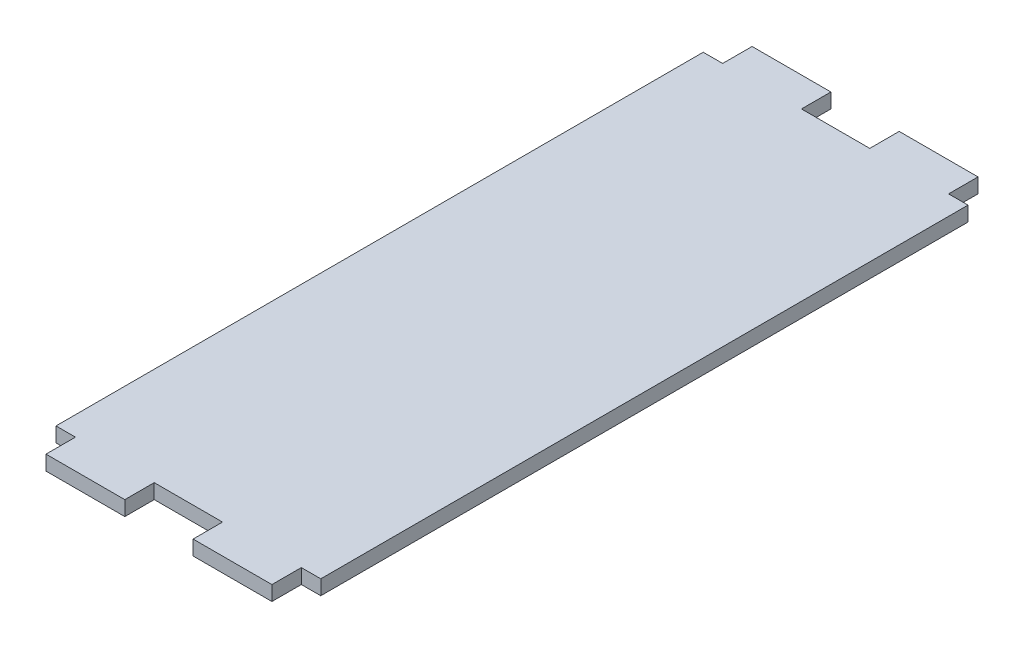
ISO-10303-21;
HEADER;
FILE_DESCRIPTION(('STEP AP214'),'2;1');
FILE_NAME('part.step','',(''),(''),'','','');
FILE_SCHEMA(('AUTOMOTIVE_DESIGN { 1 0 10303 214 1 1 1 1 }'));
ENDSEC;
DATA;
#1=APPLICATION_CONTEXT('core data for automotive mechanical design processes');
#2=APPLICATION_PROTOCOL_DEFINITION('international standard','automotive_design',2000,#1);
#3=PRODUCT_CONTEXT('',#1,'mechanical');
#4=PRODUCT('Part','Part','',(#3));
#5=PRODUCT_RELATED_PRODUCT_CATEGORY('part','',(#4));
#6=PRODUCT_DEFINITION_FORMATION('','',#4);
#7=PRODUCT_DEFINITION_CONTEXT('part definition',#1,'design');
#8=PRODUCT_DEFINITION('design','',#6,#7);
#9=PRODUCT_DEFINITION_SHAPE('','',#8);
#10=(LENGTH_UNIT() NAMED_UNIT(*) SI_UNIT(.MILLI.,.METRE.));
#11=(NAMED_UNIT(*) PLANE_ANGLE_UNIT() SI_UNIT($,.RADIAN.));
#12=(NAMED_UNIT(*) SI_UNIT($,.STERADIAN.) SOLID_ANGLE_UNIT());
#13=UNCERTAINTY_MEASURE_WITH_UNIT(LENGTH_MEASURE(1.E-05),#10,'distance_accuracy_value','');
#14=(GEOMETRIC_REPRESENTATION_CONTEXT(3) GLOBAL_UNCERTAINTY_ASSIGNED_CONTEXT((#13)) GLOBAL_UNIT_ASSIGNED_CONTEXT((#10,
#11,#12)) REPRESENTATION_CONTEXT('',''));
#15=CARTESIAN_POINT('',(0.,0.,0.));
#16=DIRECTION('',(0.,0.,1.));
#17=DIRECTION('',(1.,0.,0.));
#18=AXIS2_PLACEMENT_3D('',#15,#16,#17);
#19=CARTESIAN_POINT('',(-28.575,3.175,-76.2));
#20=DIRECTION('',(0.,0.,1.));
#21=DIRECTION('',(1.,0.,0.));
#22=AXIS2_PLACEMENT_3D('',#19,#20,#21);
#23=PLANE('',#22);
#24=DIRECTION('',(-1.,0.,0.));
#25=VECTOR('',#24,1.);
#26=CARTESIAN_POINT('',(-28.575,0.,-76.2));
#27=LINE('',#26,#25);
#28=CARTESIAN_POINT('',(-7.37000000000001,0.,-76.2));
#29=VERTEX_POINT('',#28);
#30=CARTESIAN_POINT('',(-24.38,0.,-76.2));
#31=VERTEX_POINT('',#30);
#32=EDGE_CURVE('E192',#29,#31,#27,.T.);
#33=ORIENTED_EDGE('',*,*,#32,.T.);
#34=DIRECTION('',(0.,1.,0.));
#35=VECTOR('',#34,1.);
#36=CARTESIAN_POINT('',(-24.38,0.,-76.2));
#37=LINE('',#36,#35);
#38=CARTESIAN_POINT('',(-24.38,3.175,-76.2));
#39=VERTEX_POINT('',#38);
#40=EDGE_CURVE('E175',#31,#39,#37,.T.);
#41=ORIENTED_EDGE('',*,*,#40,.T.);
#42=DIRECTION('',(-1.,0.,0.));
#43=VECTOR('',#42,1.);
#44=CARTESIAN_POINT('',(-28.575,3.175,-76.2));
#45=LINE('',#44,#43);
#46=CARTESIAN_POINT('',(-7.37,3.175,-76.2));
#47=VERTEX_POINT('',#46);
#48=EDGE_CURVE('E222',#47,#39,#45,.T.);
#49=ORIENTED_EDGE('',*,*,#48,.F.);
#50=DIRECTION('',(0.,1.,0.));
#51=VECTOR('',#50,1.);
#52=CARTESIAN_POINT('',(-7.37,0.,-76.2));
#53=LINE('',#52,#51);
#54=EDGE_CURVE('E196',#29,#47,#53,.T.);
#55=ORIENTED_EDGE('',*,*,#54,.F.);
#56=EDGE_LOOP('',(#33,#41,#49,#55));
#57=FACE_BOUND('',#56,.T.);
#58=ADVANCED_FACE('F35',(#57),#23,.F.);
#59=CARTESIAN_POINT('',(24.38,0.,-76.2));
#60=VERTEX_POINT('',#59);
#61=CARTESIAN_POINT('',(7.37,0.,-76.2));
#62=VERTEX_POINT('',#61);
#63=EDGE_CURVE('E197',#60,#62,#27,.T.);
#64=ORIENTED_EDGE('',*,*,#63,.T.);
#65=DIRECTION('',(0.,1.,0.));
#66=VECTOR('',#65,1.);
#67=CARTESIAN_POINT('',(7.37,0.,-76.2));
#68=LINE('',#67,#66);
#69=CARTESIAN_POINT('',(7.37,3.175,-76.2));
#70=VERTEX_POINT('',#69);
#71=EDGE_CURVE('E321',#62,#70,#68,.T.);
#72=ORIENTED_EDGE('',*,*,#71,.T.);
#73=CARTESIAN_POINT('',(24.38,3.175,-76.2));
#74=VERTEX_POINT('',#73);
#75=EDGE_CURVE('E228',#74,#70,#45,.T.);
#76=ORIENTED_EDGE('',*,*,#75,.F.);
#77=DIRECTION('',(0.,1.,0.));
#78=VECTOR('',#77,1.);
#79=CARTESIAN_POINT('',(24.38,0.,-76.2));
#80=LINE('',#79,#78);
#81=EDGE_CURVE('E301',#60,#74,#80,.T.);
#82=ORIENTED_EDGE('',*,*,#81,.F.);
#83=EDGE_LOOP('',(#64,#72,#76,#82));
#84=FACE_BOUND('',#83,.T.);
#85=ADVANCED_FACE('F367',(#84),#23,.F.);
#86=CARTESIAN_POINT('',(-28.575,3.175,-76.2));
#87=DIRECTION('',(1.,0.,0.));
#88=DIRECTION('',(0.,0.,-1.));
#89=AXIS2_PLACEMENT_3D('',#86,#87,#88);
#90=PLANE('',#89);
#91=DIRECTION('',(0.,1.,0.));
#92=VECTOR('',#91,1.);
#93=CARTESIAN_POINT('',(-28.575,0.,-69.85));
#94=LINE('',#93,#92);
#95=CARTESIAN_POINT('',(-28.575,0.,-69.85));
#96=VERTEX_POINT('',#95);
#97=CARTESIAN_POINT('',(-28.575,3.175,-69.85));
#98=VERTEX_POINT('',#97);
#99=EDGE_CURVE('E186',#96,#98,#94,.T.);
#100=ORIENTED_EDGE('',*,*,#99,.F.);
#101=DIRECTION('',(0.,0.,1.));
#102=VECTOR('',#101,1.);
#103=CARTESIAN_POINT('',(-28.575,0.,-76.2));
#104=LINE('',#103,#102);
#105=CARTESIAN_POINT('',(-28.575,0.,69.8499999999999));
#106=VERTEX_POINT('',#105);
#107=EDGE_CURVE('E201',#96,#106,#104,.T.);
#108=ORIENTED_EDGE('',*,*,#107,.T.);
#109=DIRECTION('',(0.,1.,0.));
#110=VECTOR('',#109,1.);
#111=CARTESIAN_POINT('',(-28.575,0.,69.85));
#112=LINE('',#111,#110);
#113=CARTESIAN_POINT('',(-28.575,3.175,69.85));
#114=VERTEX_POINT('',#113);
#115=EDGE_CURVE('E285',#106,#114,#112,.T.);
#116=ORIENTED_EDGE('',*,*,#115,.T.);
#117=DIRECTION('',(0.,0.,1.));
#118=VECTOR('',#117,1.);
#119=CARTESIAN_POINT('',(-28.575,3.175,-76.2));
#120=LINE('',#119,#118);
#121=EDGE_CURVE('E234',#98,#114,#120,.T.);
#122=ORIENTED_EDGE('',*,*,#121,.F.);
#123=EDGE_LOOP('',(#100,#108,#116,#122));
#124=FACE_BOUND('',#123,.T.);
#125=ADVANCED_FACE('F345',(#124),#90,.F.);
#126=CARTESIAN_POINT('',(28.575,3.175,-76.2));
#127=DIRECTION('',(-1.,0.,0.));
#128=DIRECTION('',(0.,0.,1.));
#129=AXIS2_PLACEMENT_3D('',#126,#127,#128);
#130=PLANE('',#129);
#131=DIRECTION('',(0.,0.,-1.));
#132=VECTOR('',#131,1.);
#133=CARTESIAN_POINT('',(28.575,0.,-76.2));
#134=LINE('',#133,#132);
#135=CARTESIAN_POINT('',(28.575,0.,69.85));
#136=VERTEX_POINT('',#135);
#137=CARTESIAN_POINT('',(28.575,0.,-69.85));
#138=VERTEX_POINT('',#137);
#139=EDGE_CURVE('E198',#136,#138,#134,.T.);
#140=ORIENTED_EDGE('',*,*,#139,.T.);
#141=DIRECTION('',(0.,1.,0.));
#142=VECTOR('',#141,1.);
#143=CARTESIAN_POINT('',(28.575,0.,-69.85));
#144=LINE('',#143,#142);
#145=CARTESIAN_POINT('',(28.575,3.175,-69.85));
#146=VERTEX_POINT('',#145);
#147=EDGE_CURVE('E298',#138,#146,#144,.T.);
#148=ORIENTED_EDGE('',*,*,#147,.T.);
#149=DIRECTION('',(0.,0.,-1.));
#150=VECTOR('',#149,1.);
#151=CARTESIAN_POINT('',(28.575,3.175,-76.2));
#152=LINE('',#151,#150);
#153=CARTESIAN_POINT('',(28.575,3.175,69.85));
#154=VERTEX_POINT('',#153);
#155=EDGE_CURVE('E216',#154,#146,#152,.T.);
#156=ORIENTED_EDGE('',*,*,#155,.F.);
#157=DIRECTION('',(0.,1.,0.));
#158=VECTOR('',#157,1.);
#159=CARTESIAN_POINT('',(28.575,0.,69.85));
#160=LINE('',#159,#158);
#161=EDGE_CURVE('E250',#136,#154,#160,.T.);
#162=ORIENTED_EDGE('',*,*,#161,.F.);
#163=EDGE_LOOP('',(#140,#148,#156,#162));
#164=FACE_BOUND('',#163,.T.);
#165=ADVANCED_FACE('F37',(#164),#130,.F.);
#166=CARTESIAN_POINT('',(-28.575,3.175,76.2));
#167=DIRECTION('',(0.,0.,-1.));
#168=DIRECTION('',(-1.,0.,0.));
#169=AXIS2_PLACEMENT_3D('',#166,#167,#168);
#170=PLANE('',#169);
#171=DIRECTION('',(0.,1.,0.));
#172=VECTOR('',#171,1.);
#173=CARTESIAN_POINT('',(-24.38,0.,76.2));
#174=LINE('',#173,#172);
#175=CARTESIAN_POINT('',(-24.38,0.,76.2));
#176=VERTEX_POINT('',#175);
#177=CARTESIAN_POINT('',(-24.38,3.175,76.2));
#178=VERTEX_POINT('',#177);
#179=EDGE_CURVE('E203',#176,#178,#174,.T.);
#180=ORIENTED_EDGE('',*,*,#179,.F.);
#181=DIRECTION('',(1.,0.,0.));
#182=VECTOR('',#181,1.);
#183=CARTESIAN_POINT('',(-28.575,0.,76.2));
#184=LINE('',#183,#182);
#185=CARTESIAN_POINT('',(-7.37,0.,76.2));
#186=VERTEX_POINT('',#185);
#187=EDGE_CURVE('E210',#176,#186,#184,.T.);
#188=ORIENTED_EDGE('',*,*,#187,.T.);
#189=DIRECTION('',(0.,1.,0.));
#190=VECTOR('',#189,1.);
#191=CARTESIAN_POINT('',(-7.37,0.,76.2));
#192=LINE('',#191,#190);
#193=CARTESIAN_POINT('',(-7.37,3.175,76.2));
#194=VERTEX_POINT('',#193);
#195=EDGE_CURVE('E267',#186,#194,#192,.T.);
#196=ORIENTED_EDGE('',*,*,#195,.T.);
#197=DIRECTION('',(1.,0.,0.));
#198=VECTOR('',#197,1.);
#199=CARTESIAN_POINT('',(-28.575,3.175,76.2));
#200=LINE('',#199,#198);
#201=EDGE_CURVE('E11',#178,#194,#200,.T.);
#202=ORIENTED_EDGE('',*,*,#201,.F.);
#203=EDGE_LOOP('',(#180,#188,#196,#202));
#204=FACE_BOUND('',#203,.T.);
#205=ADVANCED_FACE('F400',(#204),#170,.F.);
#206=DIRECTION('',(0.,1.,0.));
#207=VECTOR('',#206,1.);
#208=CARTESIAN_POINT('',(7.37,0.,76.2));
#209=LINE('',#208,#207);
#210=CARTESIAN_POINT('',(7.37,0.,76.2));
#211=VERTEX_POINT('',#210);
#212=CARTESIAN_POINT('',(7.37,3.175,76.2));
#213=VERTEX_POINT('',#212);
#214=EDGE_CURVE('E245',#211,#213,#209,.T.);
#215=ORIENTED_EDGE('',*,*,#214,.F.);
#216=CARTESIAN_POINT('',(24.38,0.,76.2));
#217=VERTEX_POINT('',#216);
#218=EDGE_CURVE('E39',#211,#217,#184,.T.);
#219=ORIENTED_EDGE('',*,*,#218,.T.);
#220=DIRECTION('',(0.,1.,0.));
#221=VECTOR('',#220,1.);
#222=CARTESIAN_POINT('',(24.38,0.,76.2));
#223=LINE('',#222,#221);
#224=CARTESIAN_POINT('',(24.38,3.175,76.2));
#225=VERTEX_POINT('',#224);
#226=EDGE_CURVE('E246',#217,#225,#223,.T.);
#227=ORIENTED_EDGE('',*,*,#226,.T.);
#228=EDGE_CURVE('E44',#213,#225,#200,.T.);
#229=ORIENTED_EDGE('',*,*,#228,.F.);
#230=EDGE_LOOP('',(#215,#219,#227,#229));
#231=FACE_BOUND('',#230,.T.);
#232=ADVANCED_FACE('F244',(#231),#170,.F.);
#233=CARTESIAN_POINT('',(0.,3.175,0.));
#234=DIRECTION('',(0.,1.,0.));
#235=DIRECTION('',(0.,0.,1.));
#236=AXIS2_PLACEMENT_3D('',#233,#234,#235);
#237=PLANE('',#236);
#238=DIRECTION('',(0.,0.,-1.));
#239=VECTOR('',#238,1.);
#240=CARTESIAN_POINT('',(-24.38,3.175,0.));
#241=LINE('',#240,#239);
#242=CARTESIAN_POINT('',(-24.38,3.175,-69.85));
#243=VERTEX_POINT('',#242);
#244=EDGE_CURVE('E181',#243,#39,#241,.T.);
#245=ORIENTED_EDGE('',*,*,#244,.F.);
#246=DIRECTION('',(-1.,0.,0.));
#247=VECTOR('',#246,1.);
#248=CARTESIAN_POINT('',(0.,3.175,-69.85));
#249=LINE('',#248,#247);
#250=EDGE_CURVE('E194',#243,#98,#249,.T.);
#251=ORIENTED_EDGE('',*,*,#250,.T.);
#252=ORIENTED_EDGE('',*,*,#121,.T.);
#253=DIRECTION('',(-1.,0.,0.));
#254=VECTOR('',#253,1.);
#255=CARTESIAN_POINT('',(0.,3.175,69.85));
#256=LINE('',#255,#254);
#257=CARTESIAN_POINT('',(-24.38,3.175,69.85));
#258=VERTEX_POINT('',#257);
#259=EDGE_CURVE('E289',#258,#114,#256,.T.);
#260=ORIENTED_EDGE('',*,*,#259,.F.);
#261=DIRECTION('',(0.,0.,1.));
#262=VECTOR('',#261,1.);
#263=CARTESIAN_POINT('',(-24.38,3.175,0.));
#264=LINE('',#263,#262);
#265=EDGE_CURVE('E269',#258,#178,#264,.T.);
#266=ORIENTED_EDGE('',*,*,#265,.T.);
#267=ORIENTED_EDGE('',*,*,#201,.T.);
#268=DIRECTION('',(0.,0.,1.));
#269=VECTOR('',#268,1.);
#270=CARTESIAN_POINT('',(-7.36999999999998,3.175,0.));
#271=LINE('',#270,#269);
#272=CARTESIAN_POINT('',(-7.37,3.175,69.85));
#273=VERTEX_POINT('',#272);
#274=EDGE_CURVE('E270',#273,#194,#271,.T.);
#275=ORIENTED_EDGE('',*,*,#274,.F.);
#276=DIRECTION('',(-1.,0.,0.));
#277=VECTOR('',#276,1.);
#278=CARTESIAN_POINT('',(0.,3.175,69.85));
#279=LINE('',#278,#277);
#280=CARTESIAN_POINT('',(7.37,3.175,69.85));
#281=VERTEX_POINT('',#280);
#282=EDGE_CURVE('E273',#281,#273,#279,.T.);
#283=ORIENTED_EDGE('',*,*,#282,.F.);
#284=DIRECTION('',(0.,0.,1.));
#285=VECTOR('',#284,1.);
#286=CARTESIAN_POINT('',(7.36999999999998,3.175,0.));
#287=LINE('',#286,#285);
#288=EDGE_CURVE('E243',#281,#213,#287,.T.);
#289=ORIENTED_EDGE('',*,*,#288,.T.);
#290=ORIENTED_EDGE('',*,*,#228,.T.);
#291=DIRECTION('',(0.,0.,1.));
#292=VECTOR('',#291,1.);
#293=CARTESIAN_POINT('',(24.38,3.175,0.));
#294=LINE('',#293,#292);
#295=CARTESIAN_POINT('',(24.38,3.175,69.85));
#296=VERTEX_POINT('',#295);
#297=EDGE_CURVE('E240',#296,#225,#294,.T.);
#298=ORIENTED_EDGE('',*,*,#297,.F.);
#299=DIRECTION('',(1.,0.,0.));
#300=VECTOR('',#299,1.);
#301=CARTESIAN_POINT('',(0.,3.175,69.85));
#302=LINE('',#301,#300);
#303=EDGE_CURVE('E256',#296,#154,#302,.T.);
#304=ORIENTED_EDGE('',*,*,#303,.T.);
#305=ORIENTED_EDGE('',*,*,#155,.T.);
#306=DIRECTION('',(1.,0.,0.));
#307=VECTOR('',#306,1.);
#308=CARTESIAN_POINT('',(0.,3.175,-69.85));
#309=LINE('',#308,#307);
#310=CARTESIAN_POINT('',(24.38,3.175,-69.85));
#311=VERTEX_POINT('',#310);
#312=EDGE_CURVE('E310',#311,#146,#309,.T.);
#313=ORIENTED_EDGE('',*,*,#312,.F.);
#314=DIRECTION('',(0.,0.,-1.));
#315=VECTOR('',#314,1.);
#316=CARTESIAN_POINT('',(24.38,3.175,0.));
#317=LINE('',#316,#315);
#318=EDGE_CURVE('E306',#311,#74,#317,.T.);
#319=ORIENTED_EDGE('',*,*,#318,.T.);
#320=ORIENTED_EDGE('',*,*,#75,.T.);
#321=DIRECTION('',(0.,0.,-1.));
#322=VECTOR('',#321,1.);
#323=CARTESIAN_POINT('',(7.36999999999998,3.175,0.));
#324=LINE('',#323,#322);
#325=CARTESIAN_POINT('',(7.37,3.175,-69.85));
#326=VERTEX_POINT('',#325);
#327=EDGE_CURVE('E324',#326,#70,#324,.T.);
#328=ORIENTED_EDGE('',*,*,#327,.F.);
#329=DIRECTION('',(-1.,0.,0.));
#330=VECTOR('',#329,1.);
#331=CARTESIAN_POINT('',(0.,3.175,-69.85));
#332=LINE('',#331,#330);
#333=CARTESIAN_POINT('',(-7.37,3.175,-69.85));
#334=VERTEX_POINT('',#333);
#335=EDGE_CURVE('E326',#326,#334,#332,.T.);
#336=ORIENTED_EDGE('',*,*,#335,.T.);
#337=DIRECTION('',(0.,0.,-1.));
#338=VECTOR('',#337,1.);
#339=CARTESIAN_POINT('',(-7.36999999999998,3.175,0.));
#340=LINE('',#339,#338);
#341=EDGE_CURVE('E305',#334,#47,#340,.T.);
#342=ORIENTED_EDGE('',*,*,#341,.T.);
#343=ORIENTED_EDGE('',*,*,#48,.T.);
#344=EDGE_LOOP('',(#245,#251,#252,#260,#266,#267,#275,#283,#289,#290,#298,#304,#305,#313,#319,
#320,#328,#336,#342,#343));
#345=FACE_BOUND('',#344,.T.);
#346=ADVANCED_FACE('F239',(#345),#237,.T.);
#347=CARTESIAN_POINT('',(0.,0.,0.));
#348=DIRECTION('',(0.,1.,0.));
#349=DIRECTION('',(0.,0.,1.));
#350=AXIS2_PLACEMENT_3D('',#347,#348,#349);
#351=PLANE('',#350);
#352=DIRECTION('',(-1.,0.,0.));
#353=VECTOR('',#352,1.);
#354=CARTESIAN_POINT('',(0.,0.,-69.85));
#355=LINE('',#354,#353);
#356=CARTESIAN_POINT('',(-24.38,0.,-69.85));
#357=VERTEX_POINT('',#356);
#358=EDGE_CURVE('E187',#357,#96,#355,.T.);
#359=ORIENTED_EDGE('',*,*,#358,.F.);
#360=DIRECTION('',(0.,0.,-1.));
#361=VECTOR('',#360,1.);
#362=CARTESIAN_POINT('',(-24.38,0.,0.));
#363=LINE('',#362,#361);
#364=EDGE_CURVE('E178',#357,#31,#363,.T.);
#365=ORIENTED_EDGE('',*,*,#364,.T.);
#366=ORIENTED_EDGE('',*,*,#32,.F.);
#367=DIRECTION('',(0.,0.,-1.));
#368=VECTOR('',#367,1.);
#369=CARTESIAN_POINT('',(-7.36999999999998,0.,0.));
#370=LINE('',#369,#368);
#371=CARTESIAN_POINT('',(-7.37,0.,-69.85));
#372=VERTEX_POINT('',#371);
#373=EDGE_CURVE('E52',#372,#29,#370,.T.);
#374=ORIENTED_EDGE('',*,*,#373,.F.);
#375=DIRECTION('',(-1.,0.,0.));
#376=VECTOR('',#375,1.);
#377=CARTESIAN_POINT('',(0.,0.,-69.85));
#378=LINE('',#377,#376);
#379=CARTESIAN_POINT('',(7.37,0.,-69.85));
#380=VERTEX_POINT('',#379);
#381=EDGE_CURVE('E333',#380,#372,#378,.T.);
#382=ORIENTED_EDGE('',*,*,#381,.F.);
#383=DIRECTION('',(0.,0.,-1.));
#384=VECTOR('',#383,1.);
#385=CARTESIAN_POINT('',(7.36999999999998,0.,0.));
#386=LINE('',#385,#384);
#387=EDGE_CURVE('E317',#380,#62,#386,.T.);
#388=ORIENTED_EDGE('',*,*,#387,.T.);
#389=ORIENTED_EDGE('',*,*,#63,.F.);
#390=DIRECTION('',(0.,0.,-1.));
#391=VECTOR('',#390,1.);
#392=CARTESIAN_POINT('',(24.38,0.,0.));
#393=LINE('',#392,#391);
#394=CARTESIAN_POINT('',(24.38,0.,-69.85));
#395=VERTEX_POINT('',#394);
#396=EDGE_CURVE('E60',#395,#60,#393,.T.);
#397=ORIENTED_EDGE('',*,*,#396,.F.);
#398=DIRECTION('',(1.,0.,0.));
#399=VECTOR('',#398,1.);
#400=CARTESIAN_POINT('',(0.,0.,-69.85));
#401=LINE('',#400,#399);
#402=EDGE_CURVE('E309',#395,#138,#401,.T.);
#403=ORIENTED_EDGE('',*,*,#402,.T.);
#404=ORIENTED_EDGE('',*,*,#139,.F.);
#405=DIRECTION('',(1.,0.,0.));
#406=VECTOR('',#405,1.);
#407=CARTESIAN_POINT('',(0.,0.,69.85));
#408=LINE('',#407,#406);
#409=CARTESIAN_POINT('',(24.38,0.,69.85));
#410=VERTEX_POINT('',#409);
#411=EDGE_CURVE('E255',#410,#136,#408,.T.);
#412=ORIENTED_EDGE('',*,*,#411,.F.);
#413=DIRECTION('',(0.,0.,1.));
#414=VECTOR('',#413,1.);
#415=CARTESIAN_POINT('',(24.38,0.,0.));
#416=LINE('',#415,#414);
#417=EDGE_CURVE('E252',#410,#217,#416,.T.);
#418=ORIENTED_EDGE('',*,*,#417,.T.);
#419=ORIENTED_EDGE('',*,*,#218,.F.);
#420=DIRECTION('',(0.,0.,1.));
#421=VECTOR('',#420,1.);
#422=CARTESIAN_POINT('',(7.36999999999998,0.,0.));
#423=LINE('',#422,#421);
#424=CARTESIAN_POINT('',(7.37,0.,69.85));
#425=VERTEX_POINT('',#424);
#426=EDGE_CURVE('E272',#425,#211,#423,.T.);
#427=ORIENTED_EDGE('',*,*,#426,.F.);
#428=DIRECTION('',(-1.,0.,0.));
#429=VECTOR('',#428,1.);
#430=CARTESIAN_POINT('',(0.,0.,69.85));
#431=LINE('',#430,#429);
#432=CARTESIAN_POINT('',(-7.37,0.,69.85));
#433=VERTEX_POINT('',#432);
#434=EDGE_CURVE('E279',#425,#433,#431,.T.);
#435=ORIENTED_EDGE('',*,*,#434,.T.);
#436=DIRECTION('',(0.,0.,1.));
#437=VECTOR('',#436,1.);
#438=CARTESIAN_POINT('',(-7.36999999999998,0.,0.));
#439=LINE('',#438,#437);
#440=EDGE_CURVE('E263',#433,#186,#439,.T.);
#441=ORIENTED_EDGE('',*,*,#440,.T.);
#442=ORIENTED_EDGE('',*,*,#187,.F.);
#443=DIRECTION('',(0.,0.,1.));
#444=VECTOR('',#443,1.);
#445=CARTESIAN_POINT('',(-24.38,0.,0.));
#446=LINE('',#445,#444);
#447=CARTESIAN_POINT('',(-24.38,0.,69.85));
#448=VERTEX_POINT('',#447);
#449=EDGE_CURVE('E292',#448,#176,#446,.T.);
#450=ORIENTED_EDGE('',*,*,#449,.F.);
#451=DIRECTION('',(-1.,0.,0.));
#452=VECTOR('',#451,1.);
#453=CARTESIAN_POINT('',(0.,0.,69.85));
#454=LINE('',#453,#452);
#455=EDGE_CURVE('E286',#448,#106,#454,.T.);
#456=ORIENTED_EDGE('',*,*,#455,.T.);
#457=ORIENTED_EDGE('',*,*,#107,.F.);
#458=EDGE_LOOP('',(#359,#365,#366,#374,#382,#388,#389,#397,#403,#404,#412,#418,#419,#427,#435,
#441,#442,#450,#456,#457));
#459=FACE_BOUND('',#458,.T.);
#460=ADVANCED_FACE('F191',(#459),#351,.F.);
#461=CARTESIAN_POINT('',(0.,0.,69.85));
#462=DIRECTION('',(0.,0.,1.));
#463=DIRECTION('',(1.,0.,0.));
#464=AXIS2_PLACEMENT_3D('',#461,#462,#463);
#465=PLANE('',#464);
#466=ORIENTED_EDGE('',*,*,#303,.F.);
#467=DIRECTION('',(0.,1.,0.));
#468=VECTOR('',#467,1.);
#469=CARTESIAN_POINT('',(24.38,0.,69.85));
#470=LINE('',#469,#468);
#471=EDGE_CURVE('E231',#410,#296,#470,.T.);
#472=ORIENTED_EDGE('',*,*,#471,.F.);
#473=ORIENTED_EDGE('',*,*,#411,.T.);
#474=ORIENTED_EDGE('',*,*,#161,.T.);
#475=EDGE_LOOP('',(#466,#472,#473,#474));
#476=FACE_BOUND('',#475,.T.);
#477=ADVANCED_FACE('F378',(#476),#465,.T.);
#478=CARTESIAN_POINT('',(24.38,0.,0.));
#479=DIRECTION('',(-1.,0.,0.));
#480=DIRECTION('',(0.,0.,1.));
#481=AXIS2_PLACEMENT_3D('',#478,#479,#480);
#482=PLANE('',#481);
#483=ORIENTED_EDGE('',*,*,#297,.T.);
#484=ORIENTED_EDGE('',*,*,#226,.F.);
#485=ORIENTED_EDGE('',*,*,#417,.F.);
#486=ORIENTED_EDGE('',*,*,#471,.T.);
#487=EDGE_LOOP('',(#483,#484,#485,#486));
#488=FACE_BOUND('',#487,.T.);
#489=ADVANCED_FACE('F380',(#488),#482,.F.);
#490=CARTESIAN_POINT('',(-7.36999999999998,0.,0.));
#491=DIRECTION('',(-1.,0.,0.));
#492=DIRECTION('',(0.,0.,1.));
#493=AXIS2_PLACEMENT_3D('',#490,#491,#492);
#494=PLANE('',#493);
#495=ORIENTED_EDGE('',*,*,#274,.T.);
#496=ORIENTED_EDGE('',*,*,#195,.F.);
#497=ORIENTED_EDGE('',*,*,#440,.F.);
#498=DIRECTION('',(0.,1.,0.));
#499=VECTOR('',#498,1.);
#500=CARTESIAN_POINT('',(-7.37,0.,69.85));
#501=LINE('',#500,#499);
#502=EDGE_CURVE('E265',#433,#273,#501,.T.);
#503=ORIENTED_EDGE('',*,*,#502,.T.);
#504=EDGE_LOOP('',(#495,#496,#497,#503));
#505=FACE_BOUND('',#504,.T.);
#506=ADVANCED_FACE('F382',(#505),#494,.F.);
#507=CARTESIAN_POINT('',(0.,0.,69.85));
#508=DIRECTION('',(0.,0.,-1.));
#509=DIRECTION('',(-1.,0.,0.));
#510=AXIS2_PLACEMENT_3D('',#507,#508,#509);
#511=PLANE('',#510);
#512=ORIENTED_EDGE('',*,*,#282,.T.);
#513=ORIENTED_EDGE('',*,*,#502,.F.);
#514=ORIENTED_EDGE('',*,*,#434,.F.);
#515=DIRECTION('',(0.,1.,0.));
#516=VECTOR('',#515,1.);
#517=CARTESIAN_POINT('',(7.37,0.,69.85));
#518=LINE('',#517,#516);
#519=EDGE_CURVE('E262',#425,#281,#518,.T.);
#520=ORIENTED_EDGE('',*,*,#519,.T.);
#521=EDGE_LOOP('',(#512,#513,#514,#520));
#522=FACE_BOUND('',#521,.T.);
#523=ADVANCED_FACE('F388',(#522),#511,.F.);
#524=CARTESIAN_POINT('',(7.36999999999998,0.,0.));
#525=DIRECTION('',(-1.,0.,0.));
#526=DIRECTION('',(0.,0.,1.));
#527=AXIS2_PLACEMENT_3D('',#524,#525,#526);
#528=PLANE('',#527);
#529=ORIENTED_EDGE('',*,*,#288,.F.);
#530=ORIENTED_EDGE('',*,*,#519,.F.);
#531=ORIENTED_EDGE('',*,*,#426,.T.);
#532=ORIENTED_EDGE('',*,*,#214,.T.);
#533=EDGE_LOOP('',(#529,#530,#531,#532));
#534=FACE_BOUND('',#533,.T.);
#535=ADVANCED_FACE('F453',(#534),#528,.T.);
#536=CARTESIAN_POINT('',(-24.38,0.,0.));
#537=DIRECTION('',(-1.,0.,0.));
#538=DIRECTION('',(0.,0.,1.));
#539=AXIS2_PLACEMENT_3D('',#536,#537,#538);
#540=PLANE('',#539);
#541=ORIENTED_EDGE('',*,*,#265,.F.);
#542=DIRECTION('',(0.,1.,0.));
#543=VECTOR('',#542,1.);
#544=CARTESIAN_POINT('',(-24.38,0.,69.85));
#545=LINE('',#544,#543);
#546=EDGE_CURVE('E283',#448,#258,#545,.T.);
#547=ORIENTED_EDGE('',*,*,#546,.F.);
#548=ORIENTED_EDGE('',*,*,#449,.T.);
#549=ORIENTED_EDGE('',*,*,#179,.T.);
#550=EDGE_LOOP('',(#541,#547,#548,#549));
#551=FACE_BOUND('',#550,.T.);
#552=ADVANCED_FACE('F443',(#551),#540,.T.);
#553=CARTESIAN_POINT('',(0.,0.,69.85));
#554=DIRECTION('',(0.,0.,-1.));
#555=DIRECTION('',(-1.,0.,0.));
#556=AXIS2_PLACEMENT_3D('',#553,#554,#555);
#557=PLANE('',#556);
#558=ORIENTED_EDGE('',*,*,#259,.T.);
#559=ORIENTED_EDGE('',*,*,#115,.F.);
#560=ORIENTED_EDGE('',*,*,#455,.F.);
#561=ORIENTED_EDGE('',*,*,#546,.T.);
#562=EDGE_LOOP('',(#558,#559,#560,#561));
#563=FACE_BOUND('',#562,.T.);
#564=ADVANCED_FACE('F349',(#563),#557,.F.);
#565=CARTESIAN_POINT('',(-24.38,0.,0.));
#566=DIRECTION('',(1.,0.,0.));
#567=DIRECTION('',(0.,0.,-1.));
#568=AXIS2_PLACEMENT_3D('',#565,#566,#567);
#569=PLANE('',#568);
#570=ORIENTED_EDGE('',*,*,#244,.T.);
#571=ORIENTED_EDGE('',*,*,#40,.F.);
#572=ORIENTED_EDGE('',*,*,#364,.F.);
#573=DIRECTION('',(0.,1.,0.));
#574=VECTOR('',#573,1.);
#575=CARTESIAN_POINT('',(-24.38,0.,-69.85));
#576=LINE('',#575,#574);
#577=EDGE_CURVE('E258',#357,#243,#576,.T.);
#578=ORIENTED_EDGE('',*,*,#577,.T.);
#579=EDGE_LOOP('',(#570,#571,#572,#578));
#580=FACE_BOUND('',#579,.T.);
#581=ADVANCED_FACE('F177',(#580),#569,.F.);
#582=CARTESIAN_POINT('',(0.,0.,-69.85));
#583=DIRECTION('',(0.,0.,-1.));
#584=DIRECTION('',(-1.,0.,0.));
#585=AXIS2_PLACEMENT_3D('',#582,#583,#584);
#586=PLANE('',#585);
#587=ORIENTED_EDGE('',*,*,#250,.F.);
#588=ORIENTED_EDGE('',*,*,#577,.F.);
#589=ORIENTED_EDGE('',*,*,#358,.T.);
#590=ORIENTED_EDGE('',*,*,#99,.T.);
#591=EDGE_LOOP('',(#587,#588,#589,#590));
#592=FACE_BOUND('',#591,.T.);
#593=ADVANCED_FACE('F343',(#592),#586,.T.);
#594=CARTESIAN_POINT('',(0.,0.,-69.85));
#595=DIRECTION('',(0.,0.,1.));
#596=DIRECTION('',(1.,0.,0.));
#597=AXIS2_PLACEMENT_3D('',#594,#595,#596);
#598=PLANE('',#597);
#599=ORIENTED_EDGE('',*,*,#312,.T.);
#600=ORIENTED_EDGE('',*,*,#147,.F.);
#601=ORIENTED_EDGE('',*,*,#402,.F.);
#602=DIRECTION('',(0.,1.,0.));
#603=VECTOR('',#602,1.);
#604=CARTESIAN_POINT('',(24.38,0.,-69.85));
#605=LINE('',#604,#603);
#606=EDGE_CURVE('E303',#395,#311,#605,.T.);
#607=ORIENTED_EDGE('',*,*,#606,.T.);
#608=EDGE_LOOP('',(#599,#600,#601,#607));
#609=FACE_BOUND('',#608,.T.);
#610=ADVANCED_FACE('F509',(#609),#598,.F.);
#611=CARTESIAN_POINT('',(24.38,0.,0.));
#612=DIRECTION('',(1.,0.,0.));
#613=DIRECTION('',(0.,0.,-1.));
#614=AXIS2_PLACEMENT_3D('',#611,#612,#613);
#615=PLANE('',#614);
#616=ORIENTED_EDGE('',*,*,#318,.F.);
#617=ORIENTED_EDGE('',*,*,#606,.F.);
#618=ORIENTED_EDGE('',*,*,#396,.T.);
#619=ORIENTED_EDGE('',*,*,#81,.T.);
#620=EDGE_LOOP('',(#616,#617,#618,#619));
#621=FACE_BOUND('',#620,.T.);
#622=ADVANCED_FACE('F369',(#621),#615,.T.);
#623=CARTESIAN_POINT('',(7.36999999999998,0.,0.));
#624=DIRECTION('',(1.,0.,0.));
#625=DIRECTION('',(0.,0.,-1.));
#626=AXIS2_PLACEMENT_3D('',#623,#624,#625);
#627=PLANE('',#626);
#628=ORIENTED_EDGE('',*,*,#327,.T.);
#629=ORIENTED_EDGE('',*,*,#71,.F.);
#630=ORIENTED_EDGE('',*,*,#387,.F.);
#631=DIRECTION('',(0.,1.,0.));
#632=VECTOR('',#631,1.);
#633=CARTESIAN_POINT('',(7.37,0.,-69.85));
#634=LINE('',#633,#632);
#635=EDGE_CURVE('E319',#380,#326,#634,.T.);
#636=ORIENTED_EDGE('',*,*,#635,.T.);
#637=EDGE_LOOP('',(#628,#629,#630,#636));
#638=FACE_BOUND('',#637,.T.);
#639=ADVANCED_FACE('F363',(#638),#627,.F.);
#640=CARTESIAN_POINT('',(0.,0.,-69.85));
#641=DIRECTION('',(0.,0.,-1.));
#642=DIRECTION('',(-1.,0.,0.));
#643=AXIS2_PLACEMENT_3D('',#640,#641,#642);
#644=PLANE('',#643);
#645=ORIENTED_EDGE('',*,*,#335,.F.);
#646=ORIENTED_EDGE('',*,*,#635,.F.);
#647=ORIENTED_EDGE('',*,*,#381,.T.);
#648=DIRECTION('',(0.,1.,0.));
#649=VECTOR('',#648,1.);
#650=CARTESIAN_POINT('',(-7.37,0.,-69.85));
#651=LINE('',#650,#649);
#652=EDGE_CURVE('E316',#372,#334,#651,.T.);
#653=ORIENTED_EDGE('',*,*,#652,.T.);
#654=EDGE_LOOP('',(#645,#646,#647,#653));
#655=FACE_BOUND('',#654,.T.);
#656=ADVANCED_FACE('F361',(#655),#644,.T.);
#657=CARTESIAN_POINT('',(-7.36999999999998,0.,0.));
#658=DIRECTION('',(1.,0.,0.));
#659=DIRECTION('',(0.,0.,-1.));
#660=AXIS2_PLACEMENT_3D('',#657,#658,#659);
#661=PLANE('',#660);
#662=ORIENTED_EDGE('',*,*,#341,.F.);
#663=ORIENTED_EDGE('',*,*,#652,.F.);
#664=ORIENTED_EDGE('',*,*,#373,.T.);
#665=ORIENTED_EDGE('',*,*,#54,.T.);
#666=EDGE_LOOP('',(#662,#663,#664,#665));
#667=FACE_BOUND('',#666,.T.);
#668=ADVANCED_FACE('F356',(#667),#661,.T.);
#669=CLOSED_SHELL('',(#58,#85,#125,#165,#205,#232,#346,#460,#477,#489,#506,#523,#535,#552,#564,
#581,#593,#610,#622,#639,#656,#668));
#670=MANIFOLD_SOLID_BREP('B2',#669);
#671=ADVANCED_BREP_SHAPE_REPRESENTATION('',(#18,#670),#14);
#672=SHAPE_DEFINITION_REPRESENTATION(#9,#671);
ENDSEC;
END-ISO-10303-21;
